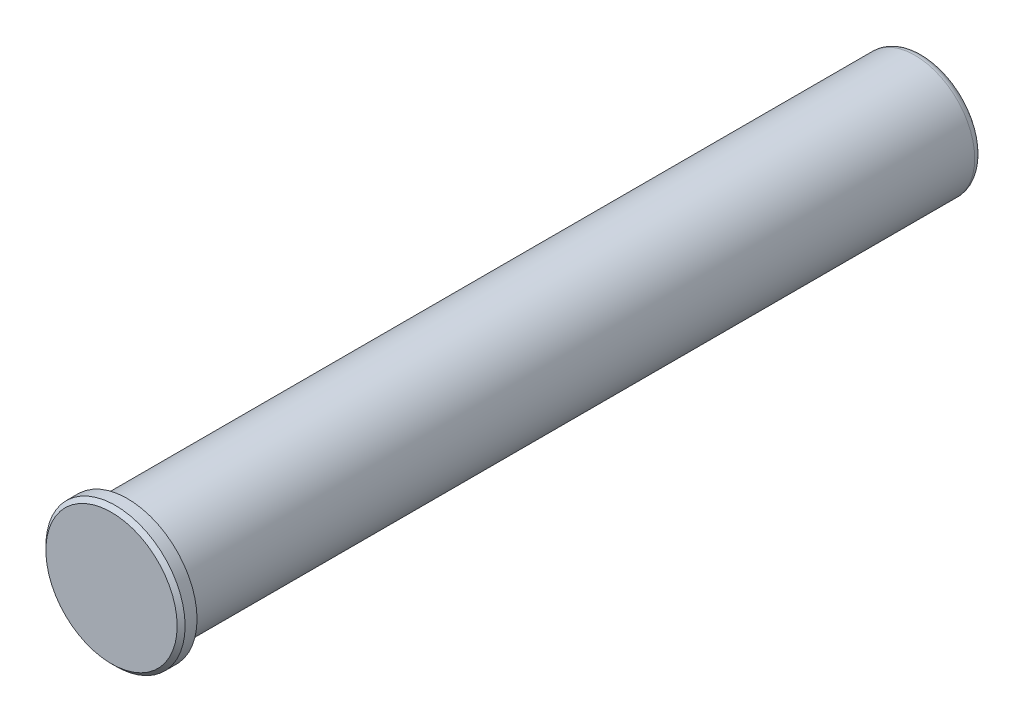
ISO-10303-21;
HEADER;
FILE_DESCRIPTION(('STEP AP214'),'2;1');
FILE_NAME('part.step','',(''),(''),'','','');
FILE_SCHEMA(('AUTOMOTIVE_DESIGN { 1 0 10303 214 1 1 1 1 }'));
ENDSEC;
DATA;
#1=APPLICATION_CONTEXT('core data for automotive mechanical design processes');
#2=APPLICATION_PROTOCOL_DEFINITION('international standard','automotive_design',2000,#1);
#3=PRODUCT_CONTEXT('',#1,'mechanical');
#4=PRODUCT('Part','Part','',(#3));
#5=PRODUCT_RELATED_PRODUCT_CATEGORY('part','',(#4));
#6=PRODUCT_DEFINITION_FORMATION('','',#4);
#7=PRODUCT_DEFINITION_CONTEXT('part definition',#1,'design');
#8=PRODUCT_DEFINITION('design','',#6,#7);
#9=PRODUCT_DEFINITION_SHAPE('','',#8);
#10=(LENGTH_UNIT() NAMED_UNIT(*) SI_UNIT(.MILLI.,.METRE.));
#11=(NAMED_UNIT(*) PLANE_ANGLE_UNIT() SI_UNIT($,.RADIAN.));
#12=(NAMED_UNIT(*) SI_UNIT($,.STERADIAN.) SOLID_ANGLE_UNIT());
#13=UNCERTAINTY_MEASURE_WITH_UNIT(LENGTH_MEASURE(1.E-05),#10,'distance_accuracy_value','');
#14=(GEOMETRIC_REPRESENTATION_CONTEXT(3) GLOBAL_UNCERTAINTY_ASSIGNED_CONTEXT((#13)) GLOBAL_UNIT_ASSIGNED_CONTEXT((#10,
#11,#12)) REPRESENTATION_CONTEXT('',''));
#15=CARTESIAN_POINT('',(0.,0.,0.));
#16=DIRECTION('',(0.,0.,1.));
#17=DIRECTION('',(1.,0.,0.));
#18=AXIS2_PLACEMENT_3D('',#15,#16,#17);
#19=CARTESIAN_POINT('',(0.,0.,200.));
#20=DIRECTION('',(0.,0.,-1.));
#21=DIRECTION('',(-1.,0.,0.));
#22=AXIS2_PLACEMENT_3D('',#19,#20,#21);
#23=CYLINDRICAL_SURFACE('',#22,15.);
#24=CARTESIAN_POINT('',(0.,0.,2.));
#25=DIRECTION('',(0.,0.,1.));
#26=DIRECTION('',(1.,0.,0.));
#27=AXIS2_PLACEMENT_3D('',#24,#25,#26);
#28=CIRCLE('',#27,15.);
#29=CARTESIAN_POINT('',(15.,0.,2.));
#30=VERTEX_POINT('',#29);
#31=EDGE_CURVE('E39',#30,#30,#28,.T.);
#32=ORIENTED_EDGE('',*,*,#31,.T.);
#33=EDGE_LOOP('',(#32));
#34=FACE_BOUND('',#33,.T.);
#35=CARTESIAN_POINT('',(0.,0.,199.5));
#36=DIRECTION('',(0.,0.,1.));
#37=DIRECTION('',(1.,0.,0.));
#38=AXIS2_PLACEMENT_3D('',#35,#36,#37);
#39=CIRCLE('',#38,15.);
#40=CARTESIAN_POINT('',(15.,0.,199.5));
#41=VERTEX_POINT('',#40);
#42=EDGE_CURVE('E52',#41,#41,#39,.F.);
#43=ORIENTED_EDGE('',*,*,#42,.T.);
#44=EDGE_LOOP('',(#43));
#45=FACE_BOUND('',#44,.T.);
#46=ADVANCED_FACE('F32',(#34,#45),#23,.T.);
#47=CARTESIAN_POINT('',(0.,0.,0.));
#48=DIRECTION('',(0.,0.,1.));
#49=DIRECTION('',(1.,0.,0.));
#50=AXIS2_PLACEMENT_3D('',#47,#48,#49);
#51=PLANE('',#50);
#52=CARTESIAN_POINT('',(0.,0.,0.));
#53=DIRECTION('',(0.,0.,1.));
#54=DIRECTION('',(1.,0.,0.));
#55=AXIS2_PLACEMENT_3D('',#52,#53,#54);
#56=CIRCLE('',#55,13.);
#57=CARTESIAN_POINT('',(13.,0.,0.));
#58=VERTEX_POINT('',#57);
#59=EDGE_CURVE('E10',#58,#58,#56,.F.);
#60=ORIENTED_EDGE('',*,*,#59,.T.);
#61=EDGE_LOOP('',(#60));
#62=FACE_BOUND('',#61,.T.);
#63=ADVANCED_FACE('F81',(#62),#51,.F.);
#64=CARTESIAN_POINT('',(0.,0.,204.));
#65=DIRECTION('',(0.,0.,-1.));
#66=DIRECTION('',(-1.,0.,0.));
#67=AXIS2_PLACEMENT_3D('',#64,#65,#66);
#68=CYLINDRICAL_SURFACE('',#67,17.5);
#69=CARTESIAN_POINT('',(0.,0.,203.));
#70=DIRECTION('',(0.,0.,1.));
#71=DIRECTION('',(1.,0.,0.));
#72=AXIS2_PLACEMENT_3D('',#69,#70,#71);
#73=CIRCLE('',#72,17.5);
#74=CARTESIAN_POINT('',(17.5,0.,203.));
#75=VERTEX_POINT('',#74);
#76=EDGE_CURVE('E43',#75,#75,#73,.F.);
#77=ORIENTED_EDGE('',*,*,#76,.T.);
#78=EDGE_LOOP('',(#77));
#79=FACE_BOUND('',#78,.T.);
#80=CARTESIAN_POINT('',(0.,0.,200.));
#81=DIRECTION('',(0.,0.,1.));
#82=DIRECTION('',(1.,0.,0.));
#83=AXIS2_PLACEMENT_3D('',#80,#81,#82);
#84=CIRCLE('',#83,17.5);
#85=CARTESIAN_POINT('',(17.5,0.,200.));
#86=VERTEX_POINT('',#85);
#87=EDGE_CURVE('E58',#86,#86,#84,.T.);
#88=ORIENTED_EDGE('',*,*,#87,.T.);
#89=EDGE_LOOP('',(#88));
#90=FACE_BOUND('',#89,.T.);
#91=ADVANCED_FACE('F62',(#79,#90),#68,.T.);
#92=CARTESIAN_POINT('',(0.,0.,204.));
#93=DIRECTION('',(0.,0.,1.));
#94=DIRECTION('',(1.,0.,0.));
#95=AXIS2_PLACEMENT_3D('',#92,#93,#94);
#96=PLANE('',#95);
#97=CARTESIAN_POINT('',(0.,0.,204.));
#98=DIRECTION('',(0.,0.,1.));
#99=DIRECTION('',(1.,0.,0.));
#100=AXIS2_PLACEMENT_3D('',#97,#98,#99);
#101=CIRCLE('',#100,16.5);
#102=CARTESIAN_POINT('',(16.5,0.,204.));
#103=VERTEX_POINT('',#102);
#104=EDGE_CURVE('E47',#103,#103,#101,.T.);
#105=ORIENTED_EDGE('',*,*,#104,.T.);
#106=EDGE_LOOP('',(#105));
#107=FACE_BOUND('',#106,.T.);
#108=ADVANCED_FACE('F67',(#107),#96,.T.);
#109=CARTESIAN_POINT('',(0.,0.,200.));
#110=DIRECTION('',(0.,0.,1.));
#111=DIRECTION('',(1.,0.,0.));
#112=AXIS2_PLACEMENT_3D('',#109,#110,#111);
#113=PLANE('',#112);
#114=CARTESIAN_POINT('',(0.,0.,200.));
#115=DIRECTION('',(0.,0.,1.));
#116=DIRECTION('',(1.,0.,0.));
#117=AXIS2_PLACEMENT_3D('',#114,#115,#116);
#118=CIRCLE('',#117,15.5);
#119=CARTESIAN_POINT('',(15.5,0.,200.));
#120=VERTEX_POINT('',#119);
#121=EDGE_CURVE('E55',#120,#120,#118,.T.);
#122=ORIENTED_EDGE('',*,*,#121,.T.);
#123=EDGE_LOOP('',(#122));
#124=FACE_BOUND('',#123,.T.);
#125=ORIENTED_EDGE('',*,*,#87,.F.);
#126=EDGE_LOOP('',(#125));
#127=FACE_BOUND('',#126,.T.);
#128=ADVANCED_FACE('F64',(#124,#127),#113,.F.);
#129=CARTESIAN_POINT('',(0.,0.,199.5));
#130=DIRECTION('',(0.,0.,1.));
#131=DIRECTION('',(1.,0.,0.));
#132=AXIS2_PLACEMENT_3D('',#129,#130,#131);
#133=TOROIDAL_SURFACE('',#132,15.5,0.5);
#134=ORIENTED_EDGE('',*,*,#42,.F.);
#135=EDGE_LOOP('',(#134));
#136=FACE_BOUND('',#135,.T.);
#137=ORIENTED_EDGE('',*,*,#121,.F.);
#138=EDGE_LOOP('',(#137));
#139=FACE_BOUND('',#138,.T.);
#140=ADVANCED_FACE('F66',(#136,#139),#133,.F.);
#141=CARTESIAN_POINT('',(0.,0.,204.));
#142=DIRECTION('',(0.,0.,-1.));
#143=DIRECTION('',(-1.,0.,0.));
#144=AXIS2_PLACEMENT_3D('',#141,#142,#143);
#145=CONICAL_SURFACE('',#144,16.5,0.785398163397457);
#146=ORIENTED_EDGE('',*,*,#76,.F.);
#147=EDGE_LOOP('',(#146));
#148=FACE_BOUND('',#147,.T.);
#149=ORIENTED_EDGE('',*,*,#104,.F.);
#150=EDGE_LOOP('',(#149));
#151=FACE_BOUND('',#150,.T.);
#152=ADVANCED_FACE('F74',(#148,#151),#145,.T.);
#153=CARTESIAN_POINT('',(0.,0.,2.));
#154=DIRECTION('',(0.,0.,1.));
#155=DIRECTION('',(1.,0.,0.));
#156=AXIS2_PLACEMENT_3D('',#153,#154,#155);
#157=TOROIDAL_SURFACE('',#156,13.,2.);
#158=ORIENTED_EDGE('',*,*,#59,.F.);
#159=EDGE_LOOP('',(#158));
#160=FACE_BOUND('',#159,.T.);
#161=ORIENTED_EDGE('',*,*,#31,.F.);
#162=EDGE_LOOP('',(#161));
#163=FACE_BOUND('',#162,.T.);
#164=ADVANCED_FACE('F34',(#160,#163),#157,.T.);
#165=CLOSED_SHELL('',(#46,#63,#91,#108,#128,#140,#152,#164));
#166=MANIFOLD_SOLID_BREP('B2',#165);
#167=ADVANCED_BREP_SHAPE_REPRESENTATION('',(#18,#166),#14);
#168=SHAPE_DEFINITION_REPRESENTATION(#9,#167);
ENDSEC;
END-ISO-10303-21;
